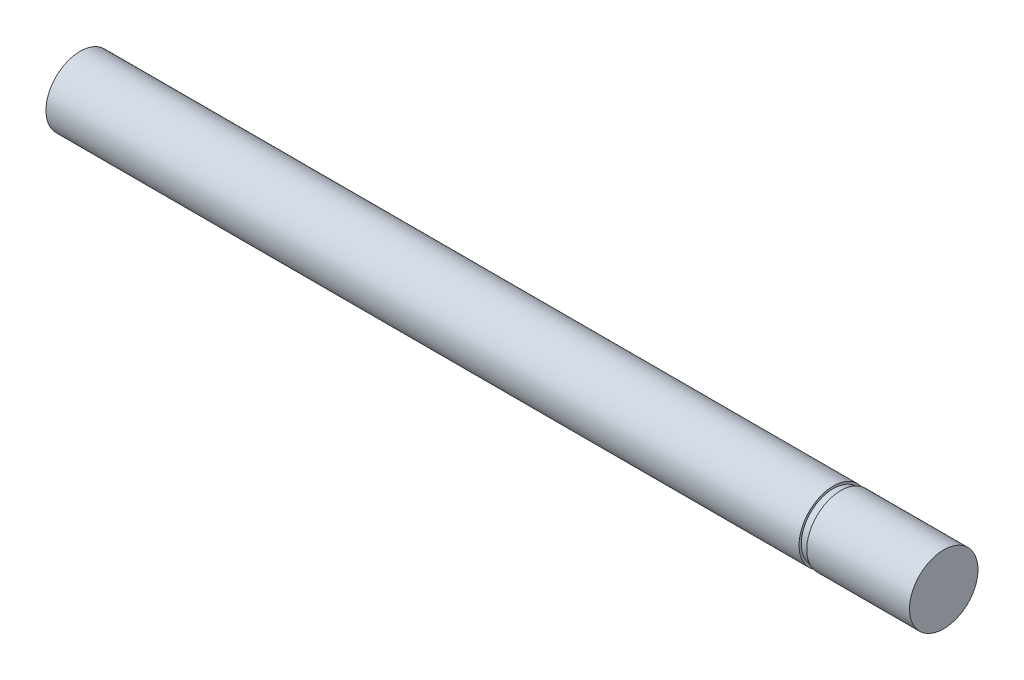
ISO-10303-21;
HEADER;
FILE_DESCRIPTION(('STEP AP214'),'2;1');
FILE_NAME('part.step','',(''),(''),'','','');
FILE_SCHEMA(('AUTOMOTIVE_DESIGN { 1 0 10303 214 1 1 1 1 }'));
ENDSEC;
DATA;
#1=APPLICATION_CONTEXT('core data for automotive mechanical design processes');
#2=APPLICATION_PROTOCOL_DEFINITION('international standard','automotive_design',2000,#1);
#3=PRODUCT_CONTEXT('',#1,'mechanical');
#4=PRODUCT('Part','Part','',(#3));
#5=PRODUCT_RELATED_PRODUCT_CATEGORY('part','',(#4));
#6=PRODUCT_DEFINITION_FORMATION('','',#4);
#7=PRODUCT_DEFINITION_CONTEXT('part definition',#1,'design');
#8=PRODUCT_DEFINITION('design','',#6,#7);
#9=PRODUCT_DEFINITION_SHAPE('','',#8);
#10=(LENGTH_UNIT() NAMED_UNIT(*) SI_UNIT(.MILLI.,.METRE.));
#11=(NAMED_UNIT(*) PLANE_ANGLE_UNIT() SI_UNIT($,.RADIAN.));
#12=(NAMED_UNIT(*) SI_UNIT($,.STERADIAN.) SOLID_ANGLE_UNIT());
#13=UNCERTAINTY_MEASURE_WITH_UNIT(LENGTH_MEASURE(1.E-05),#10,'distance_accuracy_value','');
#14=(GEOMETRIC_REPRESENTATION_CONTEXT(3) GLOBAL_UNCERTAINTY_ASSIGNED_CONTEXT((#13)) GLOBAL_UNIT_ASSIGNED_CONTEXT((#10,
#11,#12)) REPRESENTATION_CONTEXT('',''));
#15=CARTESIAN_POINT('',(0.,0.,0.));
#16=DIRECTION('',(0.,0.,1.));
#17=DIRECTION('',(1.,0.,0.));
#18=AXIS2_PLACEMENT_3D('',#15,#16,#17);
#19=CARTESIAN_POINT('',(69.7992,0.,0.));
#20=DIRECTION('',(-1.,0.,0.));
#21=DIRECTION('',(0.,0.,1.));
#22=AXIS2_PLACEMENT_3D('',#19,#20,#21);
#23=CYLINDRICAL_SURFACE('',#22,6.34999999999999);
#24=CARTESIAN_POINT('',(69.7992,0.,0.));
#25=DIRECTION('',(1.,0.,0.));
#26=DIRECTION('',(0.,0.,-1.));
#27=AXIS2_PLACEMENT_3D('',#24,#25,#26);
#28=CIRCLE('',#27,6.34999999999999);
#29=CARTESIAN_POINT('',(69.7992,0.,-6.34999999999999));
#30=VERTEX_POINT('',#29);
#31=EDGE_CURVE('E11',#30,#30,#28,.T.);
#32=ORIENTED_EDGE('',*,*,#31,.F.);
#33=EDGE_LOOP('',(#32));
#34=FACE_BOUND('',#33,.T.);
#35=CARTESIAN_POINT('',(-69.7992,0.,0.));
#36=DIRECTION('',(1.,0.,0.));
#37=DIRECTION('',(0.,0.,-1.));
#38=AXIS2_PLACEMENT_3D('',#35,#36,#37);
#39=CIRCLE('',#38,6.34999999999999);
#40=CARTESIAN_POINT('',(-69.7992,0.,-6.34999999999999));
#41=VERTEX_POINT('',#40);
#42=EDGE_CURVE('E40',#41,#41,#39,.T.);
#43=ORIENTED_EDGE('',*,*,#42,.T.);
#44=EDGE_LOOP('',(#43));
#45=FACE_BOUND('',#44,.T.);
#46=ADVANCED_FACE('F37',(#34,#45),#23,.T.);
#47=CARTESIAN_POINT('',(69.7992,0.,0.));
#48=DIRECTION('',(1.,0.,0.));
#49=DIRECTION('',(0.,0.,-1.));
#50=AXIS2_PLACEMENT_3D('',#47,#48,#49);
#51=PLANE('',#50);
#52=CARTESIAN_POINT('',(69.7992,0.,0.));
#53=DIRECTION('',(-1.,0.,0.));
#54=DIRECTION('',(0.,0.,1.));
#55=AXIS2_PLACEMENT_3D('',#52,#53,#54);
#56=CIRCLE('',#55,5.9436);
#57=CARTESIAN_POINT('',(69.7992,0.,5.9436));
#58=VERTEX_POINT('',#57);
#59=EDGE_CURVE('E74',#58,#58,#56,.T.);
#60=ORIENTED_EDGE('',*,*,#59,.T.);
#61=EDGE_LOOP('',(#60));
#62=FACE_BOUND('',#61,.T.);
#63=ORIENTED_EDGE('',*,*,#31,.T.);
#64=EDGE_LOOP('',(#63));
#65=FACE_BOUND('',#64,.T.);
#66=ADVANCED_FACE('F106',(#62,#65),#51,.T.);
#67=CARTESIAN_POINT('',(-69.7992,0.,0.));
#68=DIRECTION('',(1.,0.,0.));
#69=DIRECTION('',(0.,0.,-1.));
#70=AXIS2_PLACEMENT_3D('',#67,#68,#69);
#71=PLANE('',#70);
#72=CARTESIAN_POINT('',(-69.7992,0.,0.));
#73=DIRECTION('',(-1.,0.,0.));
#74=DIRECTION('',(0.,0.,1.));
#75=AXIS2_PLACEMENT_3D('',#72,#73,#74);
#76=CIRCLE('',#75,2.5527);
#77=CARTESIAN_POINT('',(-69.7992,0.,2.5527));
#78=VERTEX_POINT('',#77);
#79=EDGE_CURVE('E59',#78,#78,#76,.T.);
#80=ORIENTED_EDGE('',*,*,#79,.F.);
#81=EDGE_LOOP('',(#80));
#82=FACE_BOUND('',#81,.T.);
#83=ORIENTED_EDGE('',*,*,#42,.F.);
#84=EDGE_LOOP('',(#83));
#85=FACE_BOUND('',#84,.T.);
#86=ADVANCED_FACE('F101',(#82,#85),#71,.F.);
#87=CARTESIAN_POINT('',(0.,0.,0.));
#88=DIRECTION('',(-1.,0.,0.));
#89=DIRECTION('',(0.,0.,1.));
#90=AXIS2_PLACEMENT_3D('',#87,#88,#89);
#91=CYLINDRICAL_SURFACE('',#90,5.9436);
#92=ORIENTED_EDGE('',*,*,#59,.F.);
#93=EDGE_LOOP('',(#92));
#94=FACE_BOUND('',#93,.T.);
#95=CARTESIAN_POINT('',(71.2216,0.,0.));
#96=DIRECTION('',(-1.,0.,0.));
#97=DIRECTION('',(0.,0.,1.));
#98=AXIS2_PLACEMENT_3D('',#95,#96,#97);
#99=CIRCLE('',#98,5.9436);
#100=CARTESIAN_POINT('',(71.2216,0.,5.9436));
#101=VERTEX_POINT('',#100);
#102=EDGE_CURVE('E72',#101,#101,#99,.T.);
#103=ORIENTED_EDGE('',*,*,#102,.T.);
#104=EDGE_LOOP('',(#103));
#105=FACE_BOUND('',#104,.T.);
#106=ADVANCED_FACE('F83',(#94,#105),#91,.T.);
#107=CARTESIAN_POINT('',(90.2716,0.,0.));
#108=DIRECTION('',(-1.,0.,0.));
#109=DIRECTION('',(0.,0.,1.));
#110=AXIS2_PLACEMENT_3D('',#107,#108,#109);
#111=CYLINDRICAL_SURFACE('',#110,6.34999999999999);
#112=CARTESIAN_POINT('',(90.2716,0.,0.));
#113=DIRECTION('',(1.,0.,0.));
#114=DIRECTION('',(0.,0.,-1.));
#115=AXIS2_PLACEMENT_3D('',#112,#113,#114);
#116=CIRCLE('',#115,6.34999999999999);
#117=CARTESIAN_POINT('',(90.2716,0.,-6.34999999999999));
#118=VERTEX_POINT('',#117);
#119=EDGE_CURVE('E65',#118,#118,#116,.T.);
#120=ORIENTED_EDGE('',*,*,#119,.F.);
#121=EDGE_LOOP('',(#120));
#122=FACE_BOUND('',#121,.T.);
#123=CARTESIAN_POINT('',(71.2216,0.,0.));
#124=DIRECTION('',(1.,0.,0.));
#125=DIRECTION('',(0.,0.,-1.));
#126=AXIS2_PLACEMENT_3D('',#123,#124,#125);
#127=CIRCLE('',#126,6.34999999999999);
#128=CARTESIAN_POINT('',(71.2216,0.,-6.34999999999999));
#129=VERTEX_POINT('',#128);
#130=EDGE_CURVE('E58',#129,#129,#127,.T.);
#131=ORIENTED_EDGE('',*,*,#130,.T.);
#132=EDGE_LOOP('',(#131));
#133=FACE_BOUND('',#132,.T.);
#134=ADVANCED_FACE('F91',(#122,#133),#111,.T.);
#135=CARTESIAN_POINT('',(90.2716,0.,0.));
#136=DIRECTION('',(1.,0.,0.));
#137=DIRECTION('',(0.,0.,-1.));
#138=AXIS2_PLACEMENT_3D('',#135,#136,#137);
#139=PLANE('',#138);
#140=ORIENTED_EDGE('',*,*,#119,.T.);
#141=EDGE_LOOP('',(#140));
#142=FACE_BOUND('',#141,.T.);
#143=ADVANCED_FACE('F87',(#142),#139,.T.);
#144=CARTESIAN_POINT('',(71.2216,0.,0.));
#145=DIRECTION('',(1.,0.,0.));
#146=DIRECTION('',(0.,0.,-1.));
#147=AXIS2_PLACEMENT_3D('',#144,#145,#146);
#148=PLANE('',#147);
#149=ORIENTED_EDGE('',*,*,#102,.F.);
#150=EDGE_LOOP('',(#149));
#151=FACE_BOUND('',#150,.T.);
#152=ORIENTED_EDGE('',*,*,#130,.F.);
#153=EDGE_LOOP('',(#152));
#154=FACE_BOUND('',#153,.T.);
#155=ADVANCED_FACE('F51',(#151,#154),#148,.F.);
#156=CARTESIAN_POINT('',(-53.2892,0.,0.));
#157=DIRECTION('',(-1.,0.,0.));
#158=DIRECTION('',(0.,0.,1.));
#159=AXIS2_PLACEMENT_3D('',#156,#157,#158);
#160=CONICAL_SURFACE('',#159,2.5527,1.02974425867665);
#161=CARTESIAN_POINT('',(-51.7553830978083,0.,0.));
#162=VERTEX_POINT('',#161);
#163=VERTEX_LOOP('',#162);
#164=FACE_BOUND('',#163,.T.);
#165=CARTESIAN_POINT('',(-53.2892,0.,0.));
#166=DIRECTION('',(-1.,0.,0.));
#167=DIRECTION('',(0.,0.,1.));
#168=AXIS2_PLACEMENT_3D('',#165,#166,#167);
#169=CIRCLE('',#168,2.5527);
#170=CARTESIAN_POINT('',(-53.2892,0.,2.5527));
#171=VERTEX_POINT('',#170);
#172=EDGE_CURVE('E55',#171,#171,#169,.T.);
#173=ORIENTED_EDGE('',*,*,#172,.T.);
#174=EDGE_LOOP('',(#173));
#175=FACE_BOUND('',#174,.T.);
#176=ADVANCED_FACE('F47',(#164,#175),#160,.F.);
#177=CARTESIAN_POINT('',(-69.7992,0.,0.));
#178=DIRECTION('',(-1.,0.,0.));
#179=DIRECTION('',(0.,0.,1.));
#180=AXIS2_PLACEMENT_3D('',#177,#178,#179);
#181=CYLINDRICAL_SURFACE('',#180,2.5527);
#182=ORIENTED_EDGE('',*,*,#172,.F.);
#183=EDGE_LOOP('',(#182));
#184=FACE_BOUND('',#183,.T.);
#185=ORIENTED_EDGE('',*,*,#79,.T.);
#186=EDGE_LOOP('',(#185));
#187=FACE_BOUND('',#186,.T.);
#188=ADVANCED_FACE('F50',(#184,#187),#181,.F.);
#189=CLOSED_SHELL('',(#46,#66,#86,#106,#134,#143,#155,#176,#188));
#190=MANIFOLD_SOLID_BREP('B2',#189);
#191=ADVANCED_BREP_SHAPE_REPRESENTATION('',(#18,#190),#14);
#192=SHAPE_DEFINITION_REPRESENTATION(#9,#191);
ENDSEC;
END-ISO-10303-21;
